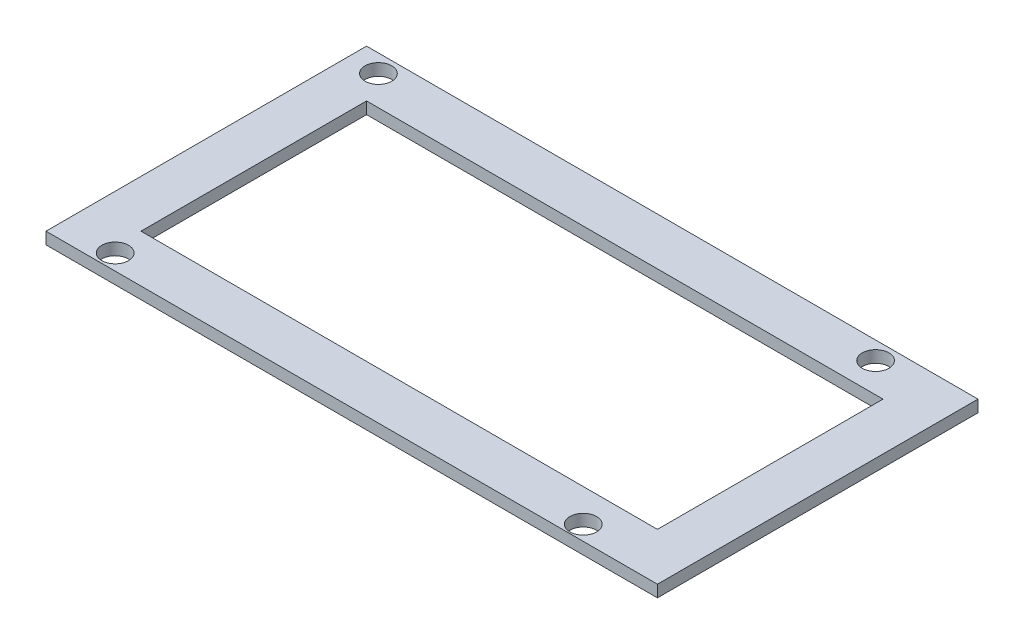
ISO-10303-21;
HEADER;
FILE_DESCRIPTION(('STEP AP214'),'2;1');
FILE_NAME('part.step','',(''),(''),'','','');
FILE_SCHEMA(('AUTOMOTIVE_DESIGN { 1 0 10303 214 1 1 1 1 }'));
ENDSEC;
DATA;
#1=APPLICATION_CONTEXT('core data for automotive mechanical design processes');
#2=APPLICATION_PROTOCOL_DEFINITION('international standard','automotive_design',2000,#1);
#3=PRODUCT_CONTEXT('',#1,'mechanical');
#4=PRODUCT('Part','Part','',(#3));
#5=PRODUCT_RELATED_PRODUCT_CATEGORY('part','',(#4));
#6=PRODUCT_DEFINITION_FORMATION('','',#4);
#7=PRODUCT_DEFINITION_CONTEXT('part definition',#1,'design');
#8=PRODUCT_DEFINITION('design','',#6,#7);
#9=PRODUCT_DEFINITION_SHAPE('','',#8);
#10=(LENGTH_UNIT() NAMED_UNIT(*) SI_UNIT(.MILLI.,.METRE.));
#11=(NAMED_UNIT(*) PLANE_ANGLE_UNIT() SI_UNIT($,.RADIAN.));
#12=(NAMED_UNIT(*) SI_UNIT($,.STERADIAN.) SOLID_ANGLE_UNIT());
#13=UNCERTAINTY_MEASURE_WITH_UNIT(LENGTH_MEASURE(1.E-05),#10,'distance_accuracy_value','');
#14=(GEOMETRIC_REPRESENTATION_CONTEXT(3) GLOBAL_UNCERTAINTY_ASSIGNED_CONTEXT((#13)) GLOBAL_UNIT_ASSIGNED_CONTEXT((#10,
#11,#12)) REPRESENTATION_CONTEXT('',''));
#15=CARTESIAN_POINT('',(0.,0.,0.));
#16=DIRECTION('',(0.,0.,1.));
#17=DIRECTION('',(1.,0.,0.));
#18=AXIS2_PLACEMENT_3D('',#15,#16,#17);
#19=CARTESIAN_POINT('',(0.,2.,0.));
#20=DIRECTION('',(0.,1.,0.));
#21=DIRECTION('',(0.,0.,1.));
#22=AXIS2_PLACEMENT_3D('',#19,#20,#21);
#23=PLANE('',#22);
#24=CARTESIAN_POINT('',(4.99999999999999,2.,-51.));
#25=DIRECTION('',(0.,1.,0.));
#26=DIRECTION('',(0.,0.,1.));
#27=AXIS2_PLACEMENT_3D('',#24,#25,#26);
#28=CIRCLE('',#27,2.25);
#29=CARTESIAN_POINT('',(4.99999999999999,2.,-48.75));
#30=VERTEX_POINT('',#29);
#31=EDGE_CURVE('E263',#30,#30,#28,.T.);
#32=ORIENTED_EDGE('',*,*,#31,.F.);
#33=EDGE_LOOP('',(#32));
#34=FACE_BOUND('',#33,.T.);
#35=DIRECTION('',(0.,0.,1.));
#36=VECTOR('',#35,1.);
#37=CARTESIAN_POINT('',(7.99999999999999,2.,-46.));
#38=LINE('',#37,#36);
#39=CARTESIAN_POINT('',(7.99999999999999,2.,-46.));
#40=VERTEX_POINT('',#39);
#41=CARTESIAN_POINT('',(8.,2.,-7.99999999999999));
#42=VERTEX_POINT('',#41);
#43=EDGE_CURVE('E114',#40,#42,#38,.T.);
#44=ORIENTED_EDGE('',*,*,#43,.F.);
#45=DIRECTION('',(-1.,0.,0.));
#46=VECTOR('',#45,1.);
#47=CARTESIAN_POINT('',(7.99999999999999,2.,-46.));
#48=LINE('',#47,#46);
#49=CARTESIAN_POINT('',(95.,2.,-46.));
#50=VERTEX_POINT('',#49);
#51=EDGE_CURVE('E106',#50,#40,#48,.T.);
#52=ORIENTED_EDGE('',*,*,#51,.F.);
#53=DIRECTION('',(0.,0.,-1.));
#54=VECTOR('',#53,1.);
#55=CARTESIAN_POINT('',(95.,2.,-46.));
#56=LINE('',#55,#54);
#57=CARTESIAN_POINT('',(95.,2.,-7.99999999999999));
#58=VERTEX_POINT('',#57);
#59=EDGE_CURVE('E129',#58,#50,#56,.T.);
#60=ORIENTED_EDGE('',*,*,#59,.F.);
#61=DIRECTION('',(1.,0.,0.));
#62=VECTOR('',#61,1.);
#63=CARTESIAN_POINT('',(8.,2.,-7.99999999999999));
#64=LINE('',#63,#62);
#65=EDGE_CURVE('E127',#42,#58,#64,.T.);
#66=ORIENTED_EDGE('',*,*,#65,.F.);
#67=EDGE_LOOP('',(#44,#52,#60,#66));
#68=FACE_BOUND('',#67,.T.);
#69=CARTESIAN_POINT('',(88.75,2.,-51.));
#70=DIRECTION('',(0.,1.,0.));
#71=DIRECTION('',(0.,0.,1.));
#72=AXIS2_PLACEMENT_3D('',#69,#70,#71);
#73=CIRCLE('',#72,2.25);
#74=CARTESIAN_POINT('',(88.75,2.,-48.75));
#75=VERTEX_POINT('',#74);
#76=EDGE_CURVE('E145',#75,#75,#73,.T.);
#77=ORIENTED_EDGE('',*,*,#76,.F.);
#78=EDGE_LOOP('',(#77));
#79=FACE_BOUND('',#78,.T.);
#80=DIRECTION('',(0.,0.,1.));
#81=VECTOR('',#80,1.);
#82=CARTESIAN_POINT('',(0.,2.,-54.));
#83=LINE('',#82,#81);
#84=CARTESIAN_POINT('',(0.,2.,-54.));
#85=VERTEX_POINT('',#84);
#86=CARTESIAN_POINT('',(0.,2.,0.));
#87=VERTEX_POINT('',#86);
#88=EDGE_CURVE('E151',#85,#87,#83,.T.);
#89=ORIENTED_EDGE('',*,*,#88,.T.);
#90=DIRECTION('',(1.,0.,0.));
#91=VECTOR('',#90,1.);
#92=CARTESIAN_POINT('',(0.,2.,0.));
#93=LINE('',#92,#91);
#94=CARTESIAN_POINT('',(103.,2.,0.));
#95=VERTEX_POINT('',#94);
#96=EDGE_CURVE('E154',#87,#95,#93,.T.);
#97=ORIENTED_EDGE('',*,*,#96,.T.);
#98=DIRECTION('',(0.,0.,-1.));
#99=VECTOR('',#98,1.);
#100=CARTESIAN_POINT('',(103.,2.,-54.));
#101=LINE('',#100,#99);
#102=CARTESIAN_POINT('',(103.,2.,-54.));
#103=VERTEX_POINT('',#102);
#104=EDGE_CURVE('E157',#95,#103,#101,.T.);
#105=ORIENTED_EDGE('',*,*,#104,.T.);
#106=DIRECTION('',(-1.,0.,0.));
#107=VECTOR('',#106,1.);
#108=CARTESIAN_POINT('',(0.,2.,-54.));
#109=LINE('',#108,#107);
#110=EDGE_CURVE('E159',#103,#85,#109,.T.);
#111=ORIENTED_EDGE('',*,*,#110,.T.);
#112=EDGE_LOOP('',(#89,#97,#105,#111));
#113=FACE_BOUND('',#112,.T.);
#114=CARTESIAN_POINT('',(88.,2.,-2.5));
#115=DIRECTION('',(0.,1.,0.));
#116=DIRECTION('',(0.,0.,1.));
#117=AXIS2_PLACEMENT_3D('',#114,#115,#116);
#118=CIRCLE('',#117,2.25);
#119=CARTESIAN_POINT('',(88.,2.,-0.250000000000006));
#120=VERTEX_POINT('',#119);
#121=EDGE_CURVE('E135',#120,#120,#118,.T.);
#122=ORIENTED_EDGE('',*,*,#121,.F.);
#123=EDGE_LOOP('',(#122));
#124=FACE_BOUND('',#123,.T.);
#125=CARTESIAN_POINT('',(9.,2.,-2.65));
#126=DIRECTION('',(0.,1.,0.));
#127=DIRECTION('',(0.,0.,1.));
#128=AXIS2_PLACEMENT_3D('',#125,#126,#127);
#129=CIRCLE('',#128,2.25);
#130=CARTESIAN_POINT('',(9.,2.,-0.400000000000001));
#131=VERTEX_POINT('',#130);
#132=EDGE_CURVE('E254',#131,#131,#129,.T.);
#133=ORIENTED_EDGE('',*,*,#132,.F.);
#134=EDGE_LOOP('',(#133));
#135=FACE_BOUND('',#134,.T.);
#136=ADVANCED_FACE('F41',(#34,#68,#79,#113,#124,#135),#23,.T.);
#137=CARTESIAN_POINT('',(0.,0.,0.));
#138=DIRECTION('',(0.,1.,0.));
#139=DIRECTION('',(0.,0.,1.));
#140=AXIS2_PLACEMENT_3D('',#137,#138,#139);
#141=PLANE('',#140);
#142=CARTESIAN_POINT('',(88.75,0.,-51.));
#143=DIRECTION('',(0.,1.,0.));
#144=DIRECTION('',(0.,0.,1.));
#145=AXIS2_PLACEMENT_3D('',#142,#143,#144);
#146=CIRCLE('',#145,2.25);
#147=CARTESIAN_POINT('',(88.75,0.,-48.75));
#148=VERTEX_POINT('',#147);
#149=EDGE_CURVE('E122',#148,#148,#146,.T.);
#150=ORIENTED_EDGE('',*,*,#149,.T.);
#151=EDGE_LOOP('',(#150));
#152=FACE_BOUND('',#151,.T.);
#153=DIRECTION('',(0.,0.,1.));
#154=VECTOR('',#153,1.);
#155=CARTESIAN_POINT('',(0.,0.,-54.));
#156=LINE('',#155,#154);
#157=CARTESIAN_POINT('',(0.,0.,-54.));
#158=VERTEX_POINT('',#157);
#159=CARTESIAN_POINT('',(0.,0.,0.));
#160=VERTEX_POINT('',#159);
#161=EDGE_CURVE('E148',#158,#160,#156,.T.);
#162=ORIENTED_EDGE('',*,*,#161,.F.);
#163=DIRECTION('',(-1.,0.,0.));
#164=VECTOR('',#163,1.);
#165=CARTESIAN_POINT('',(0.,0.,-54.));
#166=LINE('',#165,#164);
#167=CARTESIAN_POINT('',(103.,0.,-54.));
#168=VERTEX_POINT('',#167);
#169=EDGE_CURVE('E155',#168,#158,#166,.T.);
#170=ORIENTED_EDGE('',*,*,#169,.F.);
#171=DIRECTION('',(0.,0.,-1.));
#172=VECTOR('',#171,1.);
#173=CARTESIAN_POINT('',(103.,0.,-54.));
#174=LINE('',#173,#172);
#175=CARTESIAN_POINT('',(103.,0.,0.));
#176=VERTEX_POINT('',#175);
#177=EDGE_CURVE('E166',#176,#168,#174,.T.);
#178=ORIENTED_EDGE('',*,*,#177,.F.);
#179=DIRECTION('',(1.,0.,0.));
#180=VECTOR('',#179,1.);
#181=CARTESIAN_POINT('',(0.,0.,0.));
#182=LINE('',#181,#180);
#183=EDGE_CURVE('E164',#160,#176,#182,.T.);
#184=ORIENTED_EDGE('',*,*,#183,.F.);
#185=EDGE_LOOP('',(#162,#170,#178,#184));
#186=FACE_BOUND('',#185,.T.);
#187=DIRECTION('',(-1.,0.,0.));
#188=VECTOR('',#187,1.);
#189=CARTESIAN_POINT('',(7.99999999999999,0.,-46.));
#190=LINE('',#189,#188);
#191=CARTESIAN_POINT('',(95.,0.,-46.));
#192=VERTEX_POINT('',#191);
#193=CARTESIAN_POINT('',(7.99999999999999,0.,-46.));
#194=VERTEX_POINT('',#193);
#195=EDGE_CURVE('E64',#192,#194,#190,.T.);
#196=ORIENTED_EDGE('',*,*,#195,.T.);
#197=DIRECTION('',(0.,0.,1.));
#198=VECTOR('',#197,1.);
#199=CARTESIAN_POINT('',(7.99999999999999,0.,-46.));
#200=LINE('',#199,#198);
#201=CARTESIAN_POINT('',(8.,0.,-7.99999999999999));
#202=VERTEX_POINT('',#201);
#203=EDGE_CURVE('E121',#194,#202,#200,.T.);
#204=ORIENTED_EDGE('',*,*,#203,.T.);
#205=DIRECTION('',(1.,0.,0.));
#206=VECTOR('',#205,1.);
#207=CARTESIAN_POINT('',(8.,0.,-7.99999999999999));
#208=LINE('',#207,#206);
#209=CARTESIAN_POINT('',(95.,0.,-7.99999999999999));
#210=VERTEX_POINT('',#209);
#211=EDGE_CURVE('E137',#202,#210,#208,.T.);
#212=ORIENTED_EDGE('',*,*,#211,.T.);
#213=DIRECTION('',(0.,0.,-1.));
#214=VECTOR('',#213,1.);
#215=CARTESIAN_POINT('',(95.,0.,-46.));
#216=LINE('',#215,#214);
#217=EDGE_CURVE('E115',#210,#192,#216,.T.);
#218=ORIENTED_EDGE('',*,*,#217,.T.);
#219=EDGE_LOOP('',(#196,#204,#212,#218));
#220=FACE_BOUND('',#219,.T.);
#221=CARTESIAN_POINT('',(88.,0.,-2.5));
#222=DIRECTION('',(0.,1.,0.));
#223=DIRECTION('',(0.,0.,1.));
#224=AXIS2_PLACEMENT_3D('',#221,#222,#223);
#225=CIRCLE('',#224,2.25);
#226=CARTESIAN_POINT('',(88.,0.,-0.250000000000006));
#227=VERTEX_POINT('',#226);
#228=EDGE_CURVE('E266',#227,#227,#225,.T.);
#229=ORIENTED_EDGE('',*,*,#228,.T.);
#230=EDGE_LOOP('',(#229));
#231=FACE_BOUND('',#230,.T.);
#232=CARTESIAN_POINT('',(4.99999999999999,0.,-51.));
#233=DIRECTION('',(0.,1.,0.));
#234=DIRECTION('',(0.,0.,1.));
#235=AXIS2_PLACEMENT_3D('',#232,#233,#234);
#236=CIRCLE('',#235,2.25);
#237=CARTESIAN_POINT('',(4.99999999999999,0.,-48.75));
#238=VERTEX_POINT('',#237);
#239=EDGE_CURVE('E260',#238,#238,#236,.T.);
#240=ORIENTED_EDGE('',*,*,#239,.T.);
#241=EDGE_LOOP('',(#240));
#242=FACE_BOUND('',#241,.T.);
#243=CARTESIAN_POINT('',(9.,0.,-2.65));
#244=DIRECTION('',(0.,1.,0.));
#245=DIRECTION('',(0.,0.,1.));
#246=AXIS2_PLACEMENT_3D('',#243,#244,#245);
#247=CIRCLE('',#246,2.25);
#248=CARTESIAN_POINT('',(9.,0.,-0.400000000000001));
#249=VERTEX_POINT('',#248);
#250=EDGE_CURVE('E257',#249,#249,#247,.T.);
#251=ORIENTED_EDGE('',*,*,#250,.T.);
#252=EDGE_LOOP('',(#251));
#253=FACE_BOUND('',#252,.T.);
#254=ADVANCED_FACE('F184',(#152,#186,#220,#231,#242,#253),#141,.F.);
#255=CARTESIAN_POINT('',(0.,2.,-54.));
#256=DIRECTION('',(1.,0.,0.));
#257=DIRECTION('',(0.,0.,-1.));
#258=AXIS2_PLACEMENT_3D('',#255,#256,#257);
#259=PLANE('',#258);
#260=ORIENTED_EDGE('',*,*,#161,.T.);
#261=DIRECTION('',(0.,-1.,0.));
#262=VECTOR('',#261,1.);
#263=CARTESIAN_POINT('',(0.,2.,0.));
#264=LINE('',#263,#262);
#265=EDGE_CURVE('E11',#87,#160,#264,.T.);
#266=ORIENTED_EDGE('',*,*,#265,.F.);
#267=ORIENTED_EDGE('',*,*,#88,.F.);
#268=DIRECTION('',(0.,-1.,0.));
#269=VECTOR('',#268,1.);
#270=CARTESIAN_POINT('',(0.,2.,-54.));
#271=LINE('',#270,#269);
#272=EDGE_CURVE('E161',#85,#158,#271,.T.);
#273=ORIENTED_EDGE('',*,*,#272,.T.);
#274=EDGE_LOOP('',(#260,#266,#267,#273));
#275=FACE_BOUND('',#274,.T.);
#276=ADVANCED_FACE('F43',(#275),#259,.F.);
#277=CARTESIAN_POINT('',(0.,2.,0.));
#278=DIRECTION('',(0.,0.,-1.));
#279=DIRECTION('',(-1.,0.,0.));
#280=AXIS2_PLACEMENT_3D('',#277,#278,#279);
#281=PLANE('',#280);
#282=ORIENTED_EDGE('',*,*,#183,.T.);
#283=DIRECTION('',(0.,-1.,0.));
#284=VECTOR('',#283,1.);
#285=CARTESIAN_POINT('',(103.,2.,0.));
#286=LINE('',#285,#284);
#287=EDGE_CURVE('E49',#95,#176,#286,.T.);
#288=ORIENTED_EDGE('',*,*,#287,.F.);
#289=ORIENTED_EDGE('',*,*,#96,.F.);
#290=ORIENTED_EDGE('',*,*,#265,.T.);
#291=EDGE_LOOP('',(#282,#288,#289,#290));
#292=FACE_BOUND('',#291,.T.);
#293=ADVANCED_FACE('F195',(#292),#281,.F.);
#294=CARTESIAN_POINT('',(103.,2.,-54.));
#295=DIRECTION('',(-1.,0.,0.));
#296=DIRECTION('',(0.,0.,1.));
#297=AXIS2_PLACEMENT_3D('',#294,#295,#296);
#298=PLANE('',#297);
#299=ORIENTED_EDGE('',*,*,#177,.T.);
#300=DIRECTION('',(0.,-1.,0.));
#301=VECTOR('',#300,1.);
#302=CARTESIAN_POINT('',(103.,2.,-54.));
#303=LINE('',#302,#301);
#304=EDGE_CURVE('E171',#103,#168,#303,.T.);
#305=ORIENTED_EDGE('',*,*,#304,.F.);
#306=ORIENTED_EDGE('',*,*,#104,.F.);
#307=ORIENTED_EDGE('',*,*,#287,.T.);
#308=EDGE_LOOP('',(#299,#305,#306,#307));
#309=FACE_BOUND('',#308,.T.);
#310=ADVANCED_FACE('F178',(#309),#298,.F.);
#311=CARTESIAN_POINT('',(0.,2.,-54.));
#312=DIRECTION('',(0.,0.,1.));
#313=DIRECTION('',(1.,0.,0.));
#314=AXIS2_PLACEMENT_3D('',#311,#312,#313);
#315=PLANE('',#314);
#316=ORIENTED_EDGE('',*,*,#169,.T.);
#317=ORIENTED_EDGE('',*,*,#272,.F.);
#318=ORIENTED_EDGE('',*,*,#110,.F.);
#319=ORIENTED_EDGE('',*,*,#304,.T.);
#320=EDGE_LOOP('',(#316,#317,#318,#319));
#321=FACE_BOUND('',#320,.T.);
#322=ADVANCED_FACE('F188',(#321),#315,.F.);
#323=CARTESIAN_POINT('',(88.75,2.,-51.));
#324=DIRECTION('',(0.,-1.,0.));
#325=DIRECTION('',(0.,0.,-1.));
#326=AXIS2_PLACEMENT_3D('',#323,#324,#325);
#327=CYLINDRICAL_SURFACE('',#326,2.25);
#328=ORIENTED_EDGE('',*,*,#76,.T.);
#329=EDGE_LOOP('',(#328));
#330=FACE_BOUND('',#329,.T.);
#331=ORIENTED_EDGE('',*,*,#149,.F.);
#332=EDGE_LOOP('',(#331));
#333=FACE_BOUND('',#332,.T.);
#334=ADVANCED_FACE('F212',(#330,#333),#327,.F.);
#335=CARTESIAN_POINT('',(7.99999999999999,2.,-46.));
#336=DIRECTION('',(0.,0.,1.));
#337=DIRECTION('',(1.,0.,0.));
#338=AXIS2_PLACEMENT_3D('',#335,#336,#337);
#339=PLANE('',#338);
#340=ORIENTED_EDGE('',*,*,#195,.F.);
#341=DIRECTION('',(0.,-1.,0.));
#342=VECTOR('',#341,1.);
#343=CARTESIAN_POINT('',(95.,2.,-46.));
#344=LINE('',#343,#342);
#345=EDGE_CURVE('E110',#50,#192,#344,.T.);
#346=ORIENTED_EDGE('',*,*,#345,.F.);
#347=ORIENTED_EDGE('',*,*,#51,.T.);
#348=DIRECTION('',(0.,-1.,0.));
#349=VECTOR('',#348,1.);
#350=CARTESIAN_POINT('',(7.99999999999999,2.,-46.));
#351=LINE('',#350,#349);
#352=EDGE_CURVE('E109',#40,#194,#351,.T.);
#353=ORIENTED_EDGE('',*,*,#352,.T.);
#354=EDGE_LOOP('',(#340,#346,#347,#353));
#355=FACE_BOUND('',#354,.T.);
#356=ADVANCED_FACE('F108',(#355),#339,.T.);
#357=CARTESIAN_POINT('',(7.99999999999999,2.,-46.));
#358=DIRECTION('',(1.,0.,0.));
#359=DIRECTION('',(0.,0.,-1.));
#360=AXIS2_PLACEMENT_3D('',#357,#358,#359);
#361=PLANE('',#360);
#362=ORIENTED_EDGE('',*,*,#203,.F.);
#363=ORIENTED_EDGE('',*,*,#352,.F.);
#364=ORIENTED_EDGE('',*,*,#43,.T.);
#365=DIRECTION('',(0.,-1.,0.));
#366=VECTOR('',#365,1.);
#367=CARTESIAN_POINT('',(8.,2.,-7.99999999999999));
#368=LINE('',#367,#366);
#369=EDGE_CURVE('E123',#42,#202,#368,.T.);
#370=ORIENTED_EDGE('',*,*,#369,.T.);
#371=EDGE_LOOP('',(#362,#363,#364,#370));
#372=FACE_BOUND('',#371,.T.);
#373=ADVANCED_FACE('F118',(#372),#361,.T.);
#374=CARTESIAN_POINT('',(8.,2.,-7.99999999999999));
#375=DIRECTION('',(0.,0.,-1.));
#376=DIRECTION('',(-1.,0.,0.));
#377=AXIS2_PLACEMENT_3D('',#374,#375,#376);
#378=PLANE('',#377);
#379=ORIENTED_EDGE('',*,*,#211,.F.);
#380=ORIENTED_EDGE('',*,*,#369,.F.);
#381=ORIENTED_EDGE('',*,*,#65,.T.);
#382=DIRECTION('',(0.,-1.,0.));
#383=VECTOR('',#382,1.);
#384=CARTESIAN_POINT('',(95.,2.,-7.99999999999999));
#385=LINE('',#384,#383);
#386=EDGE_CURVE('E56',#58,#210,#385,.T.);
#387=ORIENTED_EDGE('',*,*,#386,.T.);
#388=EDGE_LOOP('',(#379,#380,#381,#387));
#389=FACE_BOUND('',#388,.T.);
#390=ADVANCED_FACE('F229',(#389),#378,.T.);
#391=CARTESIAN_POINT('',(95.,2.,-46.));
#392=DIRECTION('',(-1.,0.,0.));
#393=DIRECTION('',(0.,0.,1.));
#394=AXIS2_PLACEMENT_3D('',#391,#392,#393);
#395=PLANE('',#394);
#396=ORIENTED_EDGE('',*,*,#217,.F.);
#397=ORIENTED_EDGE('',*,*,#386,.F.);
#398=ORIENTED_EDGE('',*,*,#59,.T.);
#399=ORIENTED_EDGE('',*,*,#345,.T.);
#400=EDGE_LOOP('',(#396,#397,#398,#399));
#401=FACE_BOUND('',#400,.T.);
#402=ADVANCED_FACE('F234',(#401),#395,.T.);
#403=CARTESIAN_POINT('',(88.,2.,-2.5));
#404=DIRECTION('',(0.,-1.,0.));
#405=DIRECTION('',(0.,0.,-1.));
#406=AXIS2_PLACEMENT_3D('',#403,#404,#405);
#407=CYLINDRICAL_SURFACE('',#406,2.25);
#408=ORIENTED_EDGE('',*,*,#121,.T.);
#409=EDGE_LOOP('',(#408));
#410=FACE_BOUND('',#409,.T.);
#411=ORIENTED_EDGE('',*,*,#228,.F.);
#412=EDGE_LOOP('',(#411));
#413=FACE_BOUND('',#412,.T.);
#414=ADVANCED_FACE('F238',(#410,#413),#407,.F.);
#415=CARTESIAN_POINT('',(4.99999999999999,2.,-51.));
#416=DIRECTION('',(0.,-1.,0.));
#417=DIRECTION('',(0.,0.,-1.));
#418=AXIS2_PLACEMENT_3D('',#415,#416,#417);
#419=CYLINDRICAL_SURFACE('',#418,2.25);
#420=ORIENTED_EDGE('',*,*,#31,.T.);
#421=EDGE_LOOP('',(#420));
#422=FACE_BOUND('',#421,.T.);
#423=ORIENTED_EDGE('',*,*,#239,.F.);
#424=EDGE_LOOP('',(#423));
#425=FACE_BOUND('',#424,.T.);
#426=ADVANCED_FACE('F241',(#422,#425),#419,.F.);
#427=CARTESIAN_POINT('',(9.,2.,-2.65));
#428=DIRECTION('',(0.,-1.,0.));
#429=DIRECTION('',(0.,0.,-1.));
#430=AXIS2_PLACEMENT_3D('',#427,#428,#429);
#431=CYLINDRICAL_SURFACE('',#430,2.25);
#432=ORIENTED_EDGE('',*,*,#132,.T.);
#433=EDGE_LOOP('',(#432));
#434=FACE_BOUND('',#433,.T.);
#435=ORIENTED_EDGE('',*,*,#250,.F.);
#436=EDGE_LOOP('',(#435));
#437=FACE_BOUND('',#436,.T.);
#438=ADVANCED_FACE('F245',(#434,#437),#431,.F.);
#439=CLOSED_SHELL('',(#136,#254,#276,#293,#310,#322,#334,#356,#373,#390,#402,#414,#426,#438));
#440=MANIFOLD_SOLID_BREP('B2',#439);
#441=ADVANCED_BREP_SHAPE_REPRESENTATION('',(#18,#440),#14);
#442=SHAPE_DEFINITION_REPRESENTATION(#9,#441);
ENDSEC;
END-ISO-10303-21;
